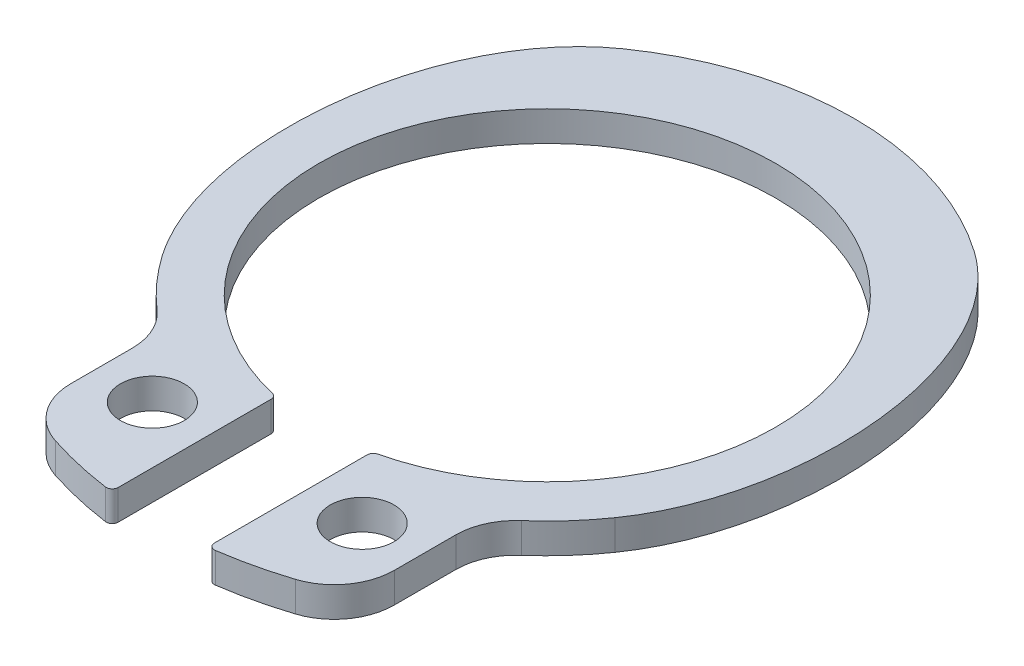
ISO-10303-21;
HEADER;
FILE_DESCRIPTION(('STEP AP214'),'2;1');
FILE_NAME('part.step','',(''),(''),'','','');
FILE_SCHEMA(('AUTOMOTIVE_DESIGN { 1 0 10303 214 1 1 1 1 }'));
ENDSEC;
DATA;
#1=APPLICATION_CONTEXT('core data for automotive mechanical design processes');
#2=APPLICATION_PROTOCOL_DEFINITION('international standard','automotive_design',2000,#1);
#3=PRODUCT_CONTEXT('',#1,'mechanical');
#4=PRODUCT('Part','Part','',(#3));
#5=PRODUCT_RELATED_PRODUCT_CATEGORY('part','',(#4));
#6=PRODUCT_DEFINITION_FORMATION('','',#4);
#7=PRODUCT_DEFINITION_CONTEXT('part definition',#1,'design');
#8=PRODUCT_DEFINITION('design','',#6,#7);
#9=PRODUCT_DEFINITION_SHAPE('','',#8);
#10=(LENGTH_UNIT() NAMED_UNIT(*) SI_UNIT(.MILLI.,.METRE.));
#11=(NAMED_UNIT(*) PLANE_ANGLE_UNIT() SI_UNIT($,.RADIAN.));
#12=(NAMED_UNIT(*) SI_UNIT($,.STERADIAN.) SOLID_ANGLE_UNIT());
#13=UNCERTAINTY_MEASURE_WITH_UNIT(LENGTH_MEASURE(1.E-05),#10,'distance_accuracy_value','');
#14=(GEOMETRIC_REPRESENTATION_CONTEXT(3) GLOBAL_UNCERTAINTY_ASSIGNED_CONTEXT((#13)) GLOBAL_UNIT_ASSIGNED_CONTEXT((#10,
#11,#12)) REPRESENTATION_CONTEXT('',''));
#15=CARTESIAN_POINT('',(0.,0.,0.));
#16=DIRECTION('',(0.,0.,1.));
#17=DIRECTION('',(1.,0.,0.));
#18=AXIS2_PLACEMENT_3D('',#15,#16,#17);
#19=CARTESIAN_POINT('',(-0.45,-0.125,3.168201382488));
#20=DIRECTION('',(0.,1.,0.));
#21=DIRECTION('',(0.,0.,1.));
#22=AXIS2_PLACEMENT_3D('',#19,#20,#21);
#23=CYLINDRICAL_SURFACE('',#22,0.0500000000000001);
#24=CARTESIAN_POINT('',(-0.45,0.125,3.168201382488));
#25=DIRECTION('',(0.,1.,0.));
#26=DIRECTION('',(0.,0.,1.));
#27=AXIS2_PLACEMENT_3D('',#24,#25,#26);
#28=CIRCLE('',#27,0.0500000000000001);
#29=CARTESIAN_POINT('',(-0.457031249999959,0.125,3.21770452908938));
#30=VERTEX_POINT('',#29);
#31=CARTESIAN_POINT('',(-0.4,0.125,3.168201382488));
#32=VERTEX_POINT('',#31);
#33=EDGE_CURVE('E202',#30,#32,#28,.T.);
#34=ORIENTED_EDGE('',*,*,#33,.F.);
#35=DIRECTION('',(0.,1.,0.));
#36=VECTOR('',#35,1.);
#37=CARTESIAN_POINT('',(-0.457031249999959,-0.125,3.21770452908938));
#38=LINE('',#37,#36);
#39=CARTESIAN_POINT('',(-0.457031249999959,-0.125,3.21770452908938));
#40=VERTEX_POINT('',#39);
#41=EDGE_CURVE('E11',#40,#30,#38,.T.);
#42=ORIENTED_EDGE('',*,*,#41,.F.);
#43=CARTESIAN_POINT('',(-0.45,-0.125,3.168201382488));
#44=DIRECTION('',(0.,1.,0.));
#45=DIRECTION('',(0.,0.,1.));
#46=AXIS2_PLACEMENT_3D('',#43,#44,#45);
#47=CIRCLE('',#46,0.0500000000000001);
#48=CARTESIAN_POINT('',(-0.4,-0.125,3.168201382488));
#49=VERTEX_POINT('',#48);
#50=EDGE_CURVE('E269',#40,#49,#47,.T.);
#51=ORIENTED_EDGE('',*,*,#50,.T.);
#52=DIRECTION('',(0.,1.,0.));
#53=VECTOR('',#52,1.);
#54=CARTESIAN_POINT('',(-0.4,-0.125,3.168201382488));
#55=LINE('',#54,#53);
#56=EDGE_CURVE('E36',#49,#32,#55,.T.);
#57=ORIENTED_EDGE('',*,*,#56,.T.);
#58=EDGE_LOOP('',(#34,#42,#51,#57));
#59=FACE_BOUND('',#58,.T.);
#60=ADVANCED_FACE('F33',(#59),#23,.T.);
#61=CARTESIAN_POINT('',(0.,-0.125,0.));
#62=DIRECTION('',(0.,1.,0.));
#63=DIRECTION('',(0.,0.,1.));
#64=AXIS2_PLACEMENT_3D('',#61,#62,#63);
#65=CYLINDRICAL_SURFACE('',#64,3.24999999999982);
#66=CARTESIAN_POINT('',(0.,0.125,0.));
#67=DIRECTION('',(0.,1.,0.));
#68=DIRECTION('',(0.,0.,1.));
#69=AXIS2_PLACEMENT_3D('',#66,#67,#68);
#70=CIRCLE('',#69,3.24999999999982);
#71=CARTESIAN_POINT('',(-0.998636363636399,0.125,3.0927698610181));
#72=VERTEX_POINT('',#71);
#73=EDGE_CURVE('E267',#72,#30,#70,.T.);
#74=ORIENTED_EDGE('',*,*,#73,.F.);
#75=DIRECTION('',(0.,1.,0.));
#76=VECTOR('',#75,1.);
#77=CARTESIAN_POINT('',(-0.998636363636399,-0.125,3.0927698610181));
#78=LINE('',#77,#76);
#79=CARTESIAN_POINT('',(-0.998636363636399,-0.125,3.0927698610181));
#80=VERTEX_POINT('',#79);
#81=EDGE_CURVE('E42',#80,#72,#78,.T.);
#82=ORIENTED_EDGE('',*,*,#81,.F.);
#83=CARTESIAN_POINT('',(0.,-0.125,0.));
#84=DIRECTION('',(0.,1.,0.));
#85=DIRECTION('',(0.,0.,1.));
#86=AXIS2_PLACEMENT_3D('',#83,#84,#85);
#87=CIRCLE('',#86,3.24999999999982);
#88=EDGE_CURVE('E192',#80,#40,#87,.T.);
#89=ORIENTED_EDGE('',*,*,#88,.T.);
#90=ORIENTED_EDGE('',*,*,#41,.T.);
#91=EDGE_LOOP('',(#74,#82,#89,#90));
#92=FACE_BOUND('',#91,.T.);
#93=ADVANCED_FACE('F305',(#92),#65,.T.);
#94=CARTESIAN_POINT('',(-0.845,-0.125,2.616959113169));
#95=DIRECTION('',(0.,1.,0.));
#96=DIRECTION('',(0.,0.,1.));
#97=AXIS2_PLACEMENT_3D('',#94,#95,#96);
#98=CYLINDRICAL_SURFACE('',#97,0.500000000000134);
#99=CARTESIAN_POINT('',(-0.845,0.125,2.616959113169));
#100=DIRECTION('',(0.,1.,0.));
#101=DIRECTION('',(0.,0.,1.));
#102=AXIS2_PLACEMENT_3D('',#99,#100,#101);
#103=CIRCLE('',#102,0.500000000000134);
#104=CARTESIAN_POINT('',(-1.34500000000013,0.125,2.61695911316899));
#105=VERTEX_POINT('',#104);
#106=EDGE_CURVE('E179',#105,#72,#103,.T.);
#107=ORIENTED_EDGE('',*,*,#106,.F.);
#108=DIRECTION('',(0.,1.,0.));
#109=VECTOR('',#108,1.);
#110=CARTESIAN_POINT('',(-1.34500000000013,-0.125,2.61695911316899));
#111=LINE('',#110,#109);
#112=CARTESIAN_POINT('',(-1.34500000000013,-0.125,2.61695911316899));
#113=VERTEX_POINT('',#112);
#114=EDGE_CURVE('E174',#113,#105,#111,.T.);
#115=ORIENTED_EDGE('',*,*,#114,.F.);
#116=CARTESIAN_POINT('',(-0.845,-0.125,2.616959113169));
#117=DIRECTION('',(0.,1.,0.));
#118=DIRECTION('',(0.,0.,1.));
#119=AXIS2_PLACEMENT_3D('',#116,#117,#118);
#120=CIRCLE('',#119,0.500000000000134);
#121=EDGE_CURVE('E177',#113,#80,#120,.T.);
#122=ORIENTED_EDGE('',*,*,#121,.T.);
#123=ORIENTED_EDGE('',*,*,#81,.T.);
#124=EDGE_LOOP('',(#107,#115,#122,#123));
#125=FACE_BOUND('',#124,.T.);
#126=ADVANCED_FACE('F176',(#125),#98,.T.);
#127=CARTESIAN_POINT('',(-1.34500000000013,-0.125,2.10617544378409));
#128=DIRECTION('',(-1.,0.,0.));
#129=DIRECTION('',(0.,0.,1.));
#130=AXIS2_PLACEMENT_3D('',#127,#128,#129);
#131=PLANE('',#130);
#132=DIRECTION('',(0.,0.,1.));
#133=VECTOR('',#132,1.);
#134=CARTESIAN_POINT('',(-1.34500000000013,0.125,2.10617544378409));
#135=LINE('',#134,#133);
#136=CARTESIAN_POINT('',(-1.34500000000013,0.125,2.10617544378409));
#137=VERTEX_POINT('',#136);
#138=EDGE_CURVE('E264',#137,#105,#135,.T.);
#139=ORIENTED_EDGE('',*,*,#138,.F.);
#140=DIRECTION('',(0.,1.,0.));
#141=VECTOR('',#140,1.);
#142=CARTESIAN_POINT('',(-1.34500000000013,-0.125,2.10617544378409));
#143=LINE('',#142,#141);
#144=CARTESIAN_POINT('',(-1.34500000000013,-0.125,2.10617544378409));
#145=VERTEX_POINT('',#144);
#146=EDGE_CURVE('E184',#145,#137,#143,.T.);
#147=ORIENTED_EDGE('',*,*,#146,.F.);
#148=DIRECTION('',(0.,0.,1.));
#149=VECTOR('',#148,1.);
#150=CARTESIAN_POINT('',(-1.34500000000013,-0.125,2.10617544378409));
#151=LINE('',#150,#149);
#152=EDGE_CURVE('E190',#145,#113,#151,.T.);
#153=ORIENTED_EDGE('',*,*,#152,.T.);
#154=ORIENTED_EDGE('',*,*,#114,.T.);
#155=EDGE_LOOP('',(#139,#147,#153,#154));
#156=FACE_BOUND('',#155,.T.);
#157=ADVANCED_FACE('F194',(#156),#131,.T.);
#158=CARTESIAN_POINT('',(-1.84500000000007,-0.125,2.10617544378409));
#159=DIRECTION('',(0.,1.,0.));
#160=DIRECTION('',(0.,0.,1.));
#161=AXIS2_PLACEMENT_3D('',#158,#159,#160);
#162=CYLINDRICAL_SURFACE('',#161,0.499999999999943);
#163=CARTESIAN_POINT('',(-1.84500000000007,0.125,2.10617544378409));
#164=DIRECTION('',(0.,-1.,0.));
#165=DIRECTION('',(0.,0.,-1.));
#166=AXIS2_PLACEMENT_3D('',#163,#164,#165);
#167=CIRCLE('',#166,0.499999999999943);
#168=CARTESIAN_POINT('',(-1.51553571428582,0.125,1.73007268596555));
#169=VERTEX_POINT('',#168);
#170=EDGE_CURVE('E261',#169,#137,#167,.T.);
#171=ORIENTED_EDGE('',*,*,#170,.F.);
#172=DIRECTION('',(0.,1.,0.));
#173=VECTOR('',#172,1.);
#174=CARTESIAN_POINT('',(-1.51553571428582,-0.125,1.73007268596555));
#175=LINE('',#174,#173);
#176=CARTESIAN_POINT('',(-1.51553571428582,-0.125,1.73007268596555));
#177=VERTEX_POINT('',#176);
#178=EDGE_CURVE('E273',#177,#169,#175,.T.);
#179=ORIENTED_EDGE('',*,*,#178,.F.);
#180=CARTESIAN_POINT('',(-1.84500000000007,-0.125,2.10617544378409));
#181=DIRECTION('',(0.,-1.,0.));
#182=DIRECTION('',(0.,0.,-1.));
#183=AXIS2_PLACEMENT_3D('',#180,#181,#182);
#184=CIRCLE('',#183,0.499999999999943);
#185=EDGE_CURVE('E195',#177,#145,#184,.T.);
#186=ORIENTED_EDGE('',*,*,#185,.T.);
#187=ORIENTED_EDGE('',*,*,#146,.T.);
#188=EDGE_LOOP('',(#171,#179,#186,#187));
#189=FACE_BOUND('',#188,.T.);
#190=ADVANCED_FACE('F318',(#189),#162,.F.);
#191=CARTESIAN_POINT('',(0.,-0.125,0.));
#192=DIRECTION('',(0.,1.,0.));
#193=DIRECTION('',(0.,0.,1.));
#194=AXIS2_PLACEMENT_3D('',#191,#192,#193);
#195=CYLINDRICAL_SURFACE('',#194,2.29999999999997);
#196=CARTESIAN_POINT('',(0.,0.125,0.));
#197=DIRECTION('',(0.,1.,0.));
#198=DIRECTION('',(0.,0.,1.));
#199=AXIS2_PLACEMENT_3D('',#196,#197,#198);
#200=CIRCLE('',#199,2.29999999999997);
#201=CARTESIAN_POINT('',(-1.88404970186493,0.125,1.31922580360695));
#202=VERTEX_POINT('',#201);
#203=EDGE_CURVE('E255',#202,#169,#200,.T.);
#204=ORIENTED_EDGE('',*,*,#203,.F.);
#205=DIRECTION('',(0.,1.,0.));
#206=VECTOR('',#205,1.);
#207=CARTESIAN_POINT('',(-1.88404970186493,-0.125,1.31922580360695));
#208=LINE('',#207,#206);
#209=CARTESIAN_POINT('',(-1.88404970186493,-0.125,1.31922580360695));
#210=VERTEX_POINT('',#209);
#211=EDGE_CURVE('E275',#210,#202,#208,.T.);
#212=ORIENTED_EDGE('',*,*,#211,.F.);
#213=CARTESIAN_POINT('',(0.,-0.125,0.));
#214=DIRECTION('',(0.,1.,0.));
#215=DIRECTION('',(0.,0.,1.));
#216=AXIS2_PLACEMENT_3D('',#213,#214,#215);
#217=CIRCLE('',#216,2.29999999999997);
#218=EDGE_CURVE('E197',#210,#177,#217,.T.);
#219=ORIENTED_EDGE('',*,*,#218,.T.);
#220=ORIENTED_EDGE('',*,*,#178,.T.);
#221=EDGE_LOOP('',(#204,#212,#219,#220));
#222=FACE_BOUND('',#221,.T.);
#223=ADVANCED_FACE('F321',(#222),#195,.T.);
#224=CARTESIAN_POINT('',(-1.46261991269529,-0.125,-2.08883771293742));
#225=CARTESIAN_POINT('',(-1.6155306939898,-0.125,-1.98176843120135));
#226=CARTESIAN_POINT('',(-1.74786933276423,-0.125,-1.84200515271834));
#227=CARTESIAN_POINT('',(-1.85450095274819,-0.125,-1.68878884892801));
#228=CARTESIAN_POINT('',(-1.99546026918019,-0.125,-1.48624793796961));
#229=CARTESIAN_POINT('',(-2.0977800915544,-0.125,-1.25460186872934));
#230=CARTESIAN_POINT('',(-2.16732858795415,-0.125,-1.01784174508229));
#231=CARTESIAN_POINT('',(-2.26444958592378,-0.125,-0.687218069829198));
#232=CARTESIAN_POINT('',(-2.30237871375998,-0.125,-0.335122463083965));
#233=CARTESIAN_POINT('',(-2.28613934206715,-0.125,0.00908791690405493));
#234=CARTESIAN_POINT('',(-2.26965827246097,-0.125,0.358421335650343));
#235=CARTESIAN_POINT('',(-2.19677877389437,-0.125,0.714119474283422));
#236=CARTESIAN_POINT('',(-2.04907703540922,-0.125,1.03112051459212));
#237=CARTESIAN_POINT('',(-2.00233491356865,-0.125,1.13143958599689));
#238=CARTESIAN_POINT('',(-1.94752972050468,-0.125,1.22856694151852));
#239=CARTESIAN_POINT('',(-1.88404970186493,-0.125,1.31922580360695));
#240=B_SPLINE_CURVE_WITH_KNOTS('',3,(#224,#225,#226,#227,#228,#229,#230,#231,#232,#233,#234,
#235,#236,#237,#238,#239),.UNSPECIFIED.,.F.,.F.,(4,3,3,3,3,4),(0.,0.000560008788456189,
0.00130088828889166,0.00233883949188015,0.00339561191091467,0.00372398774746972),.UNSPECIFIED.);
#241=DIRECTION('',(0.,1.,0.));
#242=VECTOR('',#241,1.);
#243=SURFACE_OF_LINEAR_EXTRUSION('',#240,#242);
#244=CARTESIAN_POINT('',(-1.46261991269529,0.125,-2.08883771293742));
#245=CARTESIAN_POINT('',(-1.6155306939898,0.125,-1.98176843120135));
#246=CARTESIAN_POINT('',(-1.74786933276423,0.125,-1.84200515271834));
#247=CARTESIAN_POINT('',(-1.85450095274819,0.125,-1.68878884892801));
#248=CARTESIAN_POINT('',(-1.99546026918019,0.125,-1.48624793796961));
#249=CARTESIAN_POINT('',(-2.0977800915544,0.125,-1.25460186872934));
#250=CARTESIAN_POINT('',(-2.16732858795415,0.125,-1.01784174508229));
#251=CARTESIAN_POINT('',(-2.26444958592378,0.125,-0.687218069829198));
#252=CARTESIAN_POINT('',(-2.30237871375998,0.125,-0.335122463083965));
#253=CARTESIAN_POINT('',(-2.28613934206715,0.125,0.00908791690405493));
#254=CARTESIAN_POINT('',(-2.26965827246097,0.125,0.358421335650343));
#255=CARTESIAN_POINT('',(-2.19677877389437,0.125,0.714119474283422));
#256=CARTESIAN_POINT('',(-2.04907703540922,0.125,1.03112051459212));
#257=CARTESIAN_POINT('',(-2.00233491356865,0.125,1.13143958599689));
#258=CARTESIAN_POINT('',(-1.94752972050468,0.125,1.22856694151852));
#259=CARTESIAN_POINT('',(-1.88404970186493,0.125,1.31922580360695));
#260=B_SPLINE_CURVE_WITH_KNOTS('',3,(#244,#245,#246,#247,#248,#249,#250,#251,#252,#253,#254,
#255,#256,#257,#258,#259),.UNSPECIFIED.,.F.,.F.,(4,3,3,3,3,4),(0.,0.000560008788456189,
0.00130088828889166,0.00233883949188015,0.00339561191091467,0.00372398774746972),.UNSPECIFIED.);
#261=CARTESIAN_POINT('',(-1.46261991269529,0.125,-2.08883771293742));
#262=VERTEX_POINT('',#261);
#263=EDGE_CURVE('E250',#262,#202,#260,.T.);
#264=ORIENTED_EDGE('',*,*,#263,.F.);
#265=DIRECTION('',(0.,1.,0.));
#266=VECTOR('',#265,1.);
#267=CARTESIAN_POINT('',(-1.46261991269529,-0.125,-2.08883771293742));
#268=LINE('',#267,#266);
#269=CARTESIAN_POINT('',(-1.46261991269529,-0.125,-2.08883771293742));
#270=VERTEX_POINT('',#269);
#271=EDGE_CURVE('E277',#270,#262,#268,.T.);
#272=ORIENTED_EDGE('',*,*,#271,.F.);
#273=EDGE_CURVE('E333',#270,#210,#240,.T.);
#274=ORIENTED_EDGE('',*,*,#273,.T.);
#275=ORIENTED_EDGE('',*,*,#211,.T.);
#276=EDGE_LOOP('',(#264,#272,#274,#275));
#277=FACE_BOUND('',#276,.T.);
#278=ADVANCED_FACE('F325',(#277),#243,.T.);
#279=CARTESIAN_POINT('',(0.,-0.125,0.));
#280=DIRECTION('',(0.,1.,0.));
#281=DIRECTION('',(0.,0.,1.));
#282=AXIS2_PLACEMENT_3D('',#279,#280,#281);
#283=CYLINDRICAL_SURFACE('',#282,2.55000000000047);
#284=CARTESIAN_POINT('',(0.,0.125,0.));
#285=DIRECTION('',(0.,1.,0.));
#286=DIRECTION('',(0.,0.,1.));
#287=AXIS2_PLACEMENT_3D('',#284,#285,#286);
#288=CIRCLE('',#287,2.55000000000047);
#289=CARTESIAN_POINT('',(1.46261991269531,0.125,-2.08883771293741));
#290=VERTEX_POINT('',#289);
#291=EDGE_CURVE('E244',#290,#262,#288,.T.);
#292=ORIENTED_EDGE('',*,*,#291,.F.);
#293=DIRECTION('',(0.,1.,0.));
#294=VECTOR('',#293,1.);
#295=CARTESIAN_POINT('',(1.46261991269531,-0.125,-2.08883771293741));
#296=LINE('',#295,#294);
#297=CARTESIAN_POINT('',(1.46261991269531,-0.125,-2.08883771293741));
#298=VERTEX_POINT('',#297);
#299=EDGE_CURVE('E279',#298,#290,#296,.T.);
#300=ORIENTED_EDGE('',*,*,#299,.F.);
#301=CARTESIAN_POINT('',(0.,-0.125,0.));
#302=DIRECTION('',(0.,1.,0.));
#303=DIRECTION('',(0.,0.,1.));
#304=AXIS2_PLACEMENT_3D('',#301,#302,#303);
#305=CIRCLE('',#304,2.55000000000047);
#306=EDGE_CURVE('E339',#298,#270,#305,.T.);
#307=ORIENTED_EDGE('',*,*,#306,.T.);
#308=ORIENTED_EDGE('',*,*,#271,.T.);
#309=EDGE_LOOP('',(#292,#300,#307,#308));
#310=FACE_BOUND('',#309,.T.);
#311=ADVANCED_FACE('F330',(#310),#283,.T.);
#312=CARTESIAN_POINT('',(1.88404970186525,-0.125,1.3192258036065));
#313=CARTESIAN_POINT('',(2.01902897506243,-0.125,1.1264554236381));
#314=CARTESIAN_POINT('',(2.11511016190428,-0.125,0.904375316196927));
#315=CARTESIAN_POINT('',(2.17946032705223,-0.125,0.6780152494196));
#316=CARTESIAN_POINT('',(2.27015310436415,-0.125,0.358991621720318));
#317=CARTESIAN_POINT('',(2.30250122825986,-0.125,0.0198992452615869));
#318=CARTESIAN_POINT('',(2.28538737439286,-0.125,-0.31132329457044));
#319=CARTESIAN_POINT('',(2.26784311952617,-0.125,-0.650875840803742));
#320=CARTESIAN_POINT('',(2.19755107846837,-0.125,-0.994363091037852));
#321=CARTESIAN_POINT('',(2.06391741811087,-0.125,-1.30700630198574));
#322=CARTESIAN_POINT('',(1.98464505194974,-0.125,-1.4924683108071));
#323=CARTESIAN_POINT('',(1.88078203974534,-0.125,-1.67066980685565));
#324=CARTESIAN_POINT('',(1.75028858684848,-0.125,-1.82446097534037));
#325=CARTESIAN_POINT('',(1.66602855769958,-0.125,-1.92376441203929));
#326=CARTESIAN_POINT('',(1.56930145531106,-0.125,-2.01413849261007));
#327=CARTESIAN_POINT('',(1.46261991269531,-0.125,-2.08883771293741));
#328=B_SPLINE_CURVE_WITH_KNOTS('',3,(#312,#313,#314,#315,#316,#317,#318,#319,#320,#321,#322,
#323,#324,#325,#326,#327),.UNSPECIFIED.,.F.,.F.,(4,3,3,3,3,4),(0.,0.000705987543993548,
0.00170352357713237,0.00272765257922384,0.0033307815747171,0.00371830006365464),.UNSPECIFIED.);
#329=DIRECTION('',(0.,1.,0.));
#330=VECTOR('',#329,1.);
#331=SURFACE_OF_LINEAR_EXTRUSION('',#328,#330);
#332=CARTESIAN_POINT('',(1.88404970186525,0.125,1.3192258036065));
#333=CARTESIAN_POINT('',(2.01902897506243,0.125,1.1264554236381));
#334=CARTESIAN_POINT('',(2.11511016190428,0.125,0.904375316196927));
#335=CARTESIAN_POINT('',(2.17946032705223,0.125,0.6780152494196));
#336=CARTESIAN_POINT('',(2.27015310436415,0.125,0.358991621720318));
#337=CARTESIAN_POINT('',(2.30250122825986,0.125,0.0198992452615869));
#338=CARTESIAN_POINT('',(2.28538737439286,0.125,-0.31132329457044));
#339=CARTESIAN_POINT('',(2.26784311952617,0.125,-0.650875840803742));
#340=CARTESIAN_POINT('',(2.19755107846837,0.125,-0.994363091037852));
#341=CARTESIAN_POINT('',(2.06391741811087,0.125,-1.30700630198574));
#342=CARTESIAN_POINT('',(1.98464505194974,0.125,-1.4924683108071));
#343=CARTESIAN_POINT('',(1.88078203974534,0.125,-1.67066980685565));
#344=CARTESIAN_POINT('',(1.75028858684848,0.125,-1.82446097534037));
#345=CARTESIAN_POINT('',(1.66602855769958,0.125,-1.92376441203929));
#346=CARTESIAN_POINT('',(1.56930145531106,0.125,-2.01413849261007));
#347=CARTESIAN_POINT('',(1.46261991269531,0.125,-2.08883771293741));
#348=B_SPLINE_CURVE_WITH_KNOTS('',3,(#332,#333,#334,#335,#336,#337,#338,#339,#340,#341,#342,
#343,#344,#345,#346,#347),.UNSPECIFIED.,.F.,.F.,(4,3,3,3,3,4),(0.,0.000705987543993548,
0.00170352357713237,0.00272765257922384,0.0033307815747171,0.00371830006365464),.UNSPECIFIED.);
#349=CARTESIAN_POINT('',(1.88404970186525,0.125,1.3192258036065));
#350=VERTEX_POINT('',#349);
#351=EDGE_CURVE('E239',#350,#290,#348,.T.);
#352=ORIENTED_EDGE('',*,*,#351,.F.);
#353=DIRECTION('',(0.,1.,0.));
#354=VECTOR('',#353,1.);
#355=CARTESIAN_POINT('',(1.88404970186525,-0.125,1.3192258036065));
#356=LINE('',#355,#354);
#357=CARTESIAN_POINT('',(1.88404970186525,-0.125,1.3192258036065));
#358=VERTEX_POINT('',#357);
#359=EDGE_CURVE('E281',#358,#350,#356,.T.);
#360=ORIENTED_EDGE('',*,*,#359,.F.);
#361=EDGE_CURVE('E356',#358,#298,#328,.T.);
#362=ORIENTED_EDGE('',*,*,#361,.T.);
#363=ORIENTED_EDGE('',*,*,#299,.T.);
#364=EDGE_LOOP('',(#352,#360,#362,#363));
#365=FACE_BOUND('',#364,.T.);
#366=ADVANCED_FACE('F369',(#365),#331,.T.);
#367=CARTESIAN_POINT('',(0.,-0.125,0.));
#368=DIRECTION('',(0.,1.,0.));
#369=DIRECTION('',(0.,0.,1.));
#370=AXIS2_PLACEMENT_3D('',#367,#368,#369);
#371=CYLINDRICAL_SURFACE('',#370,2.29999999999994);
#372=CARTESIAN_POINT('',(0.,0.125,0.));
#373=DIRECTION('',(0.,1.,0.));
#374=DIRECTION('',(0.,0.,1.));
#375=AXIS2_PLACEMENT_3D('',#372,#373,#374);
#376=CIRCLE('',#375,2.29999999999994);
#377=CARTESIAN_POINT('',(1.51553571428579,0.125,1.73007268596552));
#378=VERTEX_POINT('',#377);
#379=EDGE_CURVE('E236',#378,#350,#376,.T.);
#380=ORIENTED_EDGE('',*,*,#379,.F.);
#381=DIRECTION('',(0.,1.,0.));
#382=VECTOR('',#381,1.);
#383=CARTESIAN_POINT('',(1.51553571428579,-0.125,1.73007268596552));
#384=LINE('',#383,#382);
#385=CARTESIAN_POINT('',(1.51553571428579,-0.125,1.73007268596552));
#386=VERTEX_POINT('',#385);
#387=EDGE_CURVE('E283',#386,#378,#384,.T.);
#388=ORIENTED_EDGE('',*,*,#387,.F.);
#389=CARTESIAN_POINT('',(0.,-0.125,0.));
#390=DIRECTION('',(0.,1.,0.));
#391=DIRECTION('',(0.,0.,1.));
#392=AXIS2_PLACEMENT_3D('',#389,#390,#391);
#393=CIRCLE('',#392,2.29999999999994);
#394=EDGE_CURVE('E357',#386,#358,#393,.T.);
#395=ORIENTED_EDGE('',*,*,#394,.T.);
#396=ORIENTED_EDGE('',*,*,#359,.T.);
#397=EDGE_LOOP('',(#380,#388,#395,#396));
#398=FACE_BOUND('',#397,.T.);
#399=ADVANCED_FACE('F372',(#398),#371,.T.);
#400=CARTESIAN_POINT('',(1.845,-0.125,2.106175443784));
#401=DIRECTION('',(0.,1.,0.));
#402=DIRECTION('',(0.,0.,1.));
#403=AXIS2_PLACEMENT_3D('',#400,#401,#402);
#404=CYLINDRICAL_SURFACE('',#403,0.499999999999839);
#405=CARTESIAN_POINT('',(1.845,0.125,2.106175443784));
#406=DIRECTION('',(0.,-1.,0.));
#407=DIRECTION('',(0.,0.,-1.));
#408=AXIS2_PLACEMENT_3D('',#405,#406,#407);
#409=CIRCLE('',#408,0.499999999999839);
#410=CARTESIAN_POINT('',(1.34500000000015,0.125,2.10617544378404));
#411=VERTEX_POINT('',#410);
#412=EDGE_CURVE('E233',#411,#378,#409,.T.);
#413=ORIENTED_EDGE('',*,*,#412,.F.);
#414=DIRECTION('',(0.,1.,0.));
#415=VECTOR('',#414,1.);
#416=CARTESIAN_POINT('',(1.34500000000015,-0.125,2.10617544378404));
#417=LINE('',#416,#415);
#418=CARTESIAN_POINT('',(1.34500000000015,-0.125,2.10617544378404));
#419=VERTEX_POINT('',#418);
#420=EDGE_CURVE('E285',#419,#411,#417,.T.);
#421=ORIENTED_EDGE('',*,*,#420,.F.);
#422=CARTESIAN_POINT('',(1.845,-0.125,2.106175443784));
#423=DIRECTION('',(0.,-1.,0.));
#424=DIRECTION('',(0.,0.,-1.));
#425=AXIS2_PLACEMENT_3D('',#422,#423,#424);
#426=CIRCLE('',#425,0.499999999999839);
#427=EDGE_CURVE('E360',#419,#386,#426,.T.);
#428=ORIENTED_EDGE('',*,*,#427,.T.);
#429=ORIENTED_EDGE('',*,*,#387,.T.);
#430=EDGE_LOOP('',(#413,#421,#428,#429));
#431=FACE_BOUND('',#430,.T.);
#432=ADVANCED_FACE('F375',(#431),#404,.F.);
#433=CARTESIAN_POINT('',(1.34500000000015,-0.125,2.6169591131691));
#434=DIRECTION('',(1.,0.,0.));
#435=DIRECTION('',(0.,0.,-1.));
#436=AXIS2_PLACEMENT_3D('',#433,#434,#435);
#437=PLANE('',#436);
#438=DIRECTION('',(0.,0.,-1.));
#439=VECTOR('',#438,1.);
#440=CARTESIAN_POINT('',(1.34500000000015,0.125,2.6169591131691));
#441=LINE('',#440,#439);
#442=CARTESIAN_POINT('',(1.34500000000015,0.125,2.6169591131691));
#443=VERTEX_POINT('',#442);
#444=EDGE_CURVE('E230',#443,#411,#441,.T.);
#445=ORIENTED_EDGE('',*,*,#444,.F.);
#446=DIRECTION('',(0.,1.,0.));
#447=VECTOR('',#446,1.);
#448=CARTESIAN_POINT('',(1.34500000000015,-0.125,2.6169591131691));
#449=LINE('',#448,#447);
#450=CARTESIAN_POINT('',(1.34500000000015,-0.125,2.6169591131691));
#451=VERTEX_POINT('',#450);
#452=EDGE_CURVE('E287',#451,#443,#449,.T.);
#453=ORIENTED_EDGE('',*,*,#452,.F.);
#454=DIRECTION('',(0.,0.,-1.));
#455=VECTOR('',#454,1.);
#456=CARTESIAN_POINT('',(1.34500000000015,-0.125,2.6169591131691));
#457=LINE('',#456,#455);
#458=EDGE_CURVE('E470',#451,#419,#457,.T.);
#459=ORIENTED_EDGE('',*,*,#458,.T.);
#460=ORIENTED_EDGE('',*,*,#420,.T.);
#461=EDGE_LOOP('',(#445,#453,#459,#460));
#462=FACE_BOUND('',#461,.T.);
#463=ADVANCED_FACE('F379',(#462),#437,.T.);
#464=CARTESIAN_POINT('',(0.845000000000151,-0.125,2.6169591131691));
#465=DIRECTION('',(0.,1.,0.));
#466=DIRECTION('',(0.,0.,1.));
#467=AXIS2_PLACEMENT_3D('',#464,#465,#466);
#468=CYLINDRICAL_SURFACE('',#467,0.5);
#469=CARTESIAN_POINT('',(0.845000000000151,0.125,2.6169591131691));
#470=DIRECTION('',(0.,1.,0.));
#471=DIRECTION('',(0.,0.,1.));
#472=AXIS2_PLACEMENT_3D('',#469,#470,#471);
#473=CIRCLE('',#472,0.5);
#474=CARTESIAN_POINT('',(0.998636363636553,0.125,3.09276986101805));
#475=VERTEX_POINT('',#474);
#476=EDGE_CURVE('E227',#475,#443,#473,.T.);
#477=ORIENTED_EDGE('',*,*,#476,.F.);
#478=DIRECTION('',(0.,1.,0.));
#479=VECTOR('',#478,1.);
#480=CARTESIAN_POINT('',(0.998636363636553,-0.125,3.09276986101805));
#481=LINE('',#480,#479);
#482=CARTESIAN_POINT('',(0.998636363636553,-0.125,3.09276986101805));
#483=VERTEX_POINT('',#482);
#484=EDGE_CURVE('E289',#483,#475,#481,.T.);
#485=ORIENTED_EDGE('',*,*,#484,.F.);
#486=CARTESIAN_POINT('',(0.845000000000151,-0.125,2.6169591131691));
#487=DIRECTION('',(0.,1.,0.));
#488=DIRECTION('',(0.,0.,1.));
#489=AXIS2_PLACEMENT_3D('',#486,#487,#488);
#490=CIRCLE('',#489,0.5);
#491=EDGE_CURVE('E467',#483,#451,#490,.T.);
#492=ORIENTED_EDGE('',*,*,#491,.T.);
#493=ORIENTED_EDGE('',*,*,#452,.T.);
#494=EDGE_LOOP('',(#477,#485,#492,#493));
#495=FACE_BOUND('',#494,.T.);
#496=ADVANCED_FACE('F383',(#495),#468,.T.);
#497=CARTESIAN_POINT('',(0.,-0.125,0.));
#498=DIRECTION('',(0.,1.,0.));
#499=DIRECTION('',(0.,0.,1.));
#500=AXIS2_PLACEMENT_3D('',#497,#498,#499);
#501=CYLINDRICAL_SURFACE('',#500,3.24999999999983);
#502=CARTESIAN_POINT('',(0.,0.125,0.));
#503=DIRECTION('',(0.,1.,0.));
#504=DIRECTION('',(0.,0.,1.));
#505=AXIS2_PLACEMENT_3D('',#502,#503,#504);
#506=CIRCLE('',#505,3.24999999999983);
#507=CARTESIAN_POINT('',(0.457031250000104,0.125,3.21770452908936));
#508=VERTEX_POINT('',#507);
#509=EDGE_CURVE('E224',#508,#475,#506,.T.);
#510=ORIENTED_EDGE('',*,*,#509,.F.);
#511=DIRECTION('',(0.,1.,0.));
#512=VECTOR('',#511,1.);
#513=CARTESIAN_POINT('',(0.457031250000104,-0.125,3.21770452908936));
#514=LINE('',#513,#512);
#515=CARTESIAN_POINT('',(0.457031250000104,-0.125,3.21770452908936));
#516=VERTEX_POINT('',#515);
#517=EDGE_CURVE('E291',#516,#508,#514,.T.);
#518=ORIENTED_EDGE('',*,*,#517,.F.);
#519=CARTESIAN_POINT('',(0.,-0.125,0.));
#520=DIRECTION('',(0.,1.,0.));
#521=DIRECTION('',(0.,0.,1.));
#522=AXIS2_PLACEMENT_3D('',#519,#520,#521);
#523=CIRCLE('',#522,3.24999999999983);
#524=EDGE_CURVE('E464',#516,#483,#523,.T.);
#525=ORIENTED_EDGE('',*,*,#524,.T.);
#526=ORIENTED_EDGE('',*,*,#484,.T.);
#527=EDGE_LOOP('',(#510,#518,#525,#526));
#528=FACE_BOUND('',#527,.T.);
#529=ADVANCED_FACE('F387',(#528),#501,.T.);
#530=CARTESIAN_POINT('',(0.450000000000089,-0.125,3.1682013824879));
#531=DIRECTION('',(0.,1.,0.));
#532=DIRECTION('',(0.,0.,1.));
#533=AXIS2_PLACEMENT_3D('',#530,#531,#532);
#534=CYLINDRICAL_SURFACE('',#533,0.0500000000000879);
#535=CARTESIAN_POINT('',(0.450000000000089,0.125,3.1682013824879));
#536=DIRECTION('',(0.,1.,0.));
#537=DIRECTION('',(0.,0.,1.));
#538=AXIS2_PLACEMENT_3D('',#535,#536,#537);
#539=CIRCLE('',#538,0.0500000000000879);
#540=CARTESIAN_POINT('',(0.400000000000001,0.125,3.1682013824879));
#541=VERTEX_POINT('',#540);
#542=EDGE_CURVE('E221',#541,#508,#539,.T.);
#543=ORIENTED_EDGE('',*,*,#542,.F.);
#544=DIRECTION('',(0.,1.,0.));
#545=VECTOR('',#544,1.);
#546=CARTESIAN_POINT('',(0.400000000000001,-0.125,3.1682013824879));
#547=LINE('',#546,#545);
#548=CARTESIAN_POINT('',(0.400000000000001,-0.125,3.1682013824879));
#549=VERTEX_POINT('',#548);
#550=EDGE_CURVE('E293',#549,#541,#547,.T.);
#551=ORIENTED_EDGE('',*,*,#550,.F.);
#552=CARTESIAN_POINT('',(0.450000000000089,-0.125,3.1682013824879));
#553=DIRECTION('',(0.,1.,0.));
#554=DIRECTION('',(0.,0.,1.));
#555=AXIS2_PLACEMENT_3D('',#552,#553,#554);
#556=CIRCLE('',#555,0.0500000000000879);
#557=EDGE_CURVE('E461',#549,#516,#556,.T.);
#558=ORIENTED_EDGE('',*,*,#557,.T.);
#559=ORIENTED_EDGE('',*,*,#517,.T.);
#560=EDGE_LOOP('',(#543,#551,#558,#559));
#561=FACE_BOUND('',#560,.T.);
#562=ADVANCED_FACE('F391',(#561),#534,.T.);
#563=CARTESIAN_POINT('',(0.4,-0.125,1.897366596101));
#564=DIRECTION('',(-1.,0.,0.));
#565=DIRECTION('',(0.,0.,1.));
#566=AXIS2_PLACEMENT_3D('',#563,#564,#565);
#567=PLANE('',#566);
#568=DIRECTION('',(0.,0.,1.));
#569=VECTOR('',#568,1.);
#570=CARTESIAN_POINT('',(0.4,0.125,1.897366596101));
#571=LINE('',#570,#569);
#572=CARTESIAN_POINT('',(0.4,0.125,1.897366596101));
#573=VERTEX_POINT('',#572);
#574=EDGE_CURVE('E218',#573,#541,#571,.T.);
#575=ORIENTED_EDGE('',*,*,#574,.F.);
#576=DIRECTION('',(0.,1.,0.));
#577=VECTOR('',#576,1.);
#578=CARTESIAN_POINT('',(0.4,-0.125,1.897366596101));
#579=LINE('',#578,#577);
#580=CARTESIAN_POINT('',(0.4,-0.125,1.897366596101));
#581=VERTEX_POINT('',#580);
#582=EDGE_CURVE('E295',#581,#573,#579,.T.);
#583=ORIENTED_EDGE('',*,*,#582,.F.);
#584=DIRECTION('',(0.,0.,1.));
#585=VECTOR('',#584,1.);
#586=CARTESIAN_POINT('',(0.4,-0.125,1.897366596101));
#587=LINE('',#586,#585);
#588=EDGE_CURVE('E458',#581,#549,#587,.T.);
#589=ORIENTED_EDGE('',*,*,#588,.T.);
#590=ORIENTED_EDGE('',*,*,#550,.T.);
#591=EDGE_LOOP('',(#575,#583,#589,#590));
#592=FACE_BOUND('',#591,.T.);
#593=ADVANCED_FACE('F395',(#592),#567,.T.);
#594=CARTESIAN_POINT('',(0.45,-0.125,1.897366596101));
#595=DIRECTION('',(0.,1.,0.));
#596=DIRECTION('',(0.,0.,1.));
#597=AXIS2_PLACEMENT_3D('',#594,#595,#596);
#598=CYLINDRICAL_SURFACE('',#597,0.05);
#599=CARTESIAN_POINT('',(0.45,0.125,1.897366596101));
#600=DIRECTION('',(0.,1.,0.));
#601=DIRECTION('',(0.,0.,1.));
#602=AXIS2_PLACEMENT_3D('',#599,#600,#601);
#603=CIRCLE('',#602,0.05);
#604=CARTESIAN_POINT('',(0.438461538461517,0.125,1.84871617055996));
#605=VERTEX_POINT('',#604);
#606=EDGE_CURVE('E215',#605,#573,#603,.T.);
#607=ORIENTED_EDGE('',*,*,#606,.F.);
#608=DIRECTION('',(0.,1.,0.));
#609=VECTOR('',#608,1.);
#610=CARTESIAN_POINT('',(0.438461538461517,-0.125,1.84871617055996));
#611=LINE('',#610,#609);
#612=CARTESIAN_POINT('',(0.438461538461517,-0.125,1.84871617055996));
#613=VERTEX_POINT('',#612);
#614=EDGE_CURVE('E297',#613,#605,#611,.T.);
#615=ORIENTED_EDGE('',*,*,#614,.F.);
#616=CARTESIAN_POINT('',(0.45,-0.125,1.897366596101));
#617=DIRECTION('',(0.,1.,0.));
#618=DIRECTION('',(0.,0.,1.));
#619=AXIS2_PLACEMENT_3D('',#616,#617,#618);
#620=CIRCLE('',#619,0.05);
#621=EDGE_CURVE('E455',#613,#581,#620,.T.);
#622=ORIENTED_EDGE('',*,*,#621,.T.);
#623=ORIENTED_EDGE('',*,*,#582,.T.);
#624=EDGE_LOOP('',(#607,#615,#622,#623));
#625=FACE_BOUND('',#624,.T.);
#626=ADVANCED_FACE('F399',(#625),#598,.T.);
#627=CARTESIAN_POINT('',(0.,-0.125,0.));
#628=DIRECTION('',(0.,1.,0.));
#629=DIRECTION('',(0.,0.,1.));
#630=AXIS2_PLACEMENT_3D('',#627,#628,#629);
#631=CYLINDRICAL_SURFACE('',#630,1.89999999999998);
#632=CARTESIAN_POINT('',(0.,0.125,0.));
#633=DIRECTION('',(0.,-1.,0.));
#634=DIRECTION('',(0.,0.,-1.));
#635=AXIS2_PLACEMENT_3D('',#632,#633,#634);
#636=CIRCLE('',#635,1.89999999999998);
#637=CARTESIAN_POINT('',(-0.438461538461516,0.125,1.84871617055996));
#638=VERTEX_POINT('',#637);
#639=EDGE_CURVE('E212',#638,#605,#636,.T.);
#640=ORIENTED_EDGE('',*,*,#639,.F.);
#641=DIRECTION('',(0.,1.,0.));
#642=VECTOR('',#641,1.);
#643=CARTESIAN_POINT('',(-0.438461538461516,-0.125,1.84871617055996));
#644=LINE('',#643,#642);
#645=CARTESIAN_POINT('',(-0.438461538461516,-0.125,1.84871617055996));
#646=VERTEX_POINT('',#645);
#647=EDGE_CURVE('E299',#646,#638,#644,.T.);
#648=ORIENTED_EDGE('',*,*,#647,.F.);
#649=CARTESIAN_POINT('',(0.,-0.125,0.));
#650=DIRECTION('',(0.,-1.,0.));
#651=DIRECTION('',(0.,0.,-1.));
#652=AXIS2_PLACEMENT_3D('',#649,#650,#651);
#653=CIRCLE('',#652,1.89999999999998);
#654=EDGE_CURVE('E452',#646,#613,#653,.T.);
#655=ORIENTED_EDGE('',*,*,#654,.T.);
#656=ORIENTED_EDGE('',*,*,#614,.T.);
#657=EDGE_LOOP('',(#640,#648,#655,#656));
#658=FACE_BOUND('',#657,.T.);
#659=ADVANCED_FACE('F403',(#658),#631,.F.);
#660=CARTESIAN_POINT('',(-0.45,-0.125,1.897366596101));
#661=DIRECTION('',(0.,1.,0.));
#662=DIRECTION('',(0.,0.,1.));
#663=AXIS2_PLACEMENT_3D('',#660,#661,#662);
#664=CYLINDRICAL_SURFACE('',#663,0.0499999999999933);
#665=CARTESIAN_POINT('',(-0.45,0.125,1.897366596101));
#666=DIRECTION('',(0.,1.,0.));
#667=DIRECTION('',(0.,0.,1.));
#668=AXIS2_PLACEMENT_3D('',#665,#666,#667);
#669=CIRCLE('',#668,0.0499999999999933);
#670=CARTESIAN_POINT('',(-0.4,0.125,1.897366596101));
#671=VERTEX_POINT('',#670);
#672=EDGE_CURVE('E209',#671,#638,#669,.T.);
#673=ORIENTED_EDGE('',*,*,#672,.F.);
#674=DIRECTION('',(0.,1.,0.));
#675=VECTOR('',#674,1.);
#676=CARTESIAN_POINT('',(-0.4,-0.125,1.897366596101));
#677=LINE('',#676,#675);
#678=CARTESIAN_POINT('',(-0.4,-0.125,1.897366596101));
#679=VERTEX_POINT('',#678);
#680=EDGE_CURVE('E300',#679,#671,#677,.T.);
#681=ORIENTED_EDGE('',*,*,#680,.F.);
#682=CARTESIAN_POINT('',(-0.45,-0.125,1.897366596101));
#683=DIRECTION('',(0.,1.,0.));
#684=DIRECTION('',(0.,0.,1.));
#685=AXIS2_PLACEMENT_3D('',#682,#683,#684);
#686=CIRCLE('',#685,0.0499999999999933);
#687=EDGE_CURVE('E449',#679,#646,#686,.T.);
#688=ORIENTED_EDGE('',*,*,#687,.T.);
#689=ORIENTED_EDGE('',*,*,#647,.T.);
#690=EDGE_LOOP('',(#673,#681,#688,#689));
#691=FACE_BOUND('',#690,.T.);
#692=ADVANCED_FACE('F407',(#691),#664,.T.);
#693=CARTESIAN_POINT('',(-0.4,-0.125,3.168201382488));
#694=DIRECTION('',(1.,0.,0.));
#695=DIRECTION('',(0.,0.,-1.));
#696=AXIS2_PLACEMENT_3D('',#693,#694,#695);
#697=PLANE('',#696);
#698=DIRECTION('',(0.,0.,-1.));
#699=VECTOR('',#698,1.);
#700=CARTESIAN_POINT('',(-0.4,0.125,3.168201382488));
#701=LINE('',#700,#699);
#702=EDGE_CURVE('E205',#32,#671,#701,.T.);
#703=ORIENTED_EDGE('',*,*,#702,.F.);
#704=ORIENTED_EDGE('',*,*,#56,.F.);
#705=DIRECTION('',(0.,0.,-1.));
#706=VECTOR('',#705,1.);
#707=CARTESIAN_POINT('',(-0.4,-0.125,3.168201382488));
#708=LINE('',#707,#706);
#709=EDGE_CURVE('E447',#49,#679,#708,.T.);
#710=ORIENTED_EDGE('',*,*,#709,.T.);
#711=ORIENTED_EDGE('',*,*,#680,.T.);
#712=EDGE_LOOP('',(#703,#704,#710,#711));
#713=FACE_BOUND('',#712,.T.);
#714=ADVANCED_FACE('F302',(#713),#697,.T.);
#715=CARTESIAN_POINT('',(-0.45,-0.125,3.168201382488));
#716=DIRECTION('',(0.,1.,0.));
#717=DIRECTION('',(0.,0.,1.));
#718=AXIS2_PLACEMENT_3D('',#715,#716,#717);
#719=PLANE('',#718);
#720=CARTESIAN_POINT('',(-0.8725,-0.125,2.412182167598));
#721=DIRECTION('',(0.,1.,0.));
#722=DIRECTION('',(0.,0.,-1.));
#723=AXIS2_PLACEMENT_3D('',#720,#721,#722);
#724=CIRCLE('',#723,0.2651274938448);
#725=CARTESIAN_POINT('',(-0.8725,-0.125,2.1470546737532));
#726=VERTEX_POINT('',#725);
#727=EDGE_CURVE('E434',#726,#726,#724,.T.);
#728=ORIENTED_EDGE('',*,*,#727,.T.);
#729=EDGE_LOOP('',(#728));
#730=FACE_BOUND('',#729,.T.);
#731=CARTESIAN_POINT('',(0.8725,-0.125,2.412182167598));
#732=DIRECTION('',(0.,1.,0.));
#733=DIRECTION('',(0.,0.,-1.));
#734=AXIS2_PLACEMENT_3D('',#731,#732,#733);
#735=CIRCLE('',#734,0.2651274938448);
#736=CARTESIAN_POINT('',(0.8725,-0.125,2.1470546737532));
#737=VERTEX_POINT('',#736);
#738=EDGE_CURVE('E206',#737,#737,#735,.T.);
#739=ORIENTED_EDGE('',*,*,#738,.T.);
#740=EDGE_LOOP('',(#739));
#741=FACE_BOUND('',#740,.T.);
#742=ORIENTED_EDGE('',*,*,#50,.F.);
#743=ORIENTED_EDGE('',*,*,#88,.F.);
#744=ORIENTED_EDGE('',*,*,#121,.F.);
#745=ORIENTED_EDGE('',*,*,#152,.F.);
#746=ORIENTED_EDGE('',*,*,#185,.F.);
#747=ORIENTED_EDGE('',*,*,#218,.F.);
#748=ORIENTED_EDGE('',*,*,#273,.F.);
#749=ORIENTED_EDGE('',*,*,#306,.F.);
#750=ORIENTED_EDGE('',*,*,#361,.F.);
#751=ORIENTED_EDGE('',*,*,#394,.F.);
#752=ORIENTED_EDGE('',*,*,#427,.F.);
#753=ORIENTED_EDGE('',*,*,#458,.F.);
#754=ORIENTED_EDGE('',*,*,#491,.F.);
#755=ORIENTED_EDGE('',*,*,#524,.F.);
#756=ORIENTED_EDGE('',*,*,#557,.F.);
#757=ORIENTED_EDGE('',*,*,#588,.F.);
#758=ORIENTED_EDGE('',*,*,#621,.F.);
#759=ORIENTED_EDGE('',*,*,#654,.F.);
#760=ORIENTED_EDGE('',*,*,#687,.F.);
#761=ORIENTED_EDGE('',*,*,#709,.F.);
#762=EDGE_LOOP('',(#742,#743,#744,#745,#746,#747,#748,#749,#750,#751,#752,#753,#754,#755,#756,
#757,#758,#759,#760,#761));
#763=FACE_BOUND('',#762,.T.);
#764=ADVANCED_FACE('F188',(#730,#741,#763),#719,.F.);
#765=CARTESIAN_POINT('',(-0.45,0.125,3.168201382488));
#766=DIRECTION('',(0.,1.,0.));
#767=DIRECTION('',(0.,0.,1.));
#768=AXIS2_PLACEMENT_3D('',#765,#766,#767);
#769=PLANE('',#768);
#770=CARTESIAN_POINT('',(-0.8725,0.125,2.412182167598));
#771=DIRECTION('',(0.,1.,0.));
#772=DIRECTION('',(0.,0.,-1.));
#773=AXIS2_PLACEMENT_3D('',#770,#771,#772);
#774=CIRCLE('',#773,0.2651274938448);
#775=CARTESIAN_POINT('',(-0.8725,0.125,2.1470546737532));
#776=VERTEX_POINT('',#775);
#777=EDGE_CURVE('E437',#776,#776,#774,.T.);
#778=ORIENTED_EDGE('',*,*,#777,.F.);
#779=EDGE_LOOP('',(#778));
#780=FACE_BOUND('',#779,.T.);
#781=CARTESIAN_POINT('',(0.8725,0.125,2.412182167598));
#782=DIRECTION('',(0.,1.,0.));
#783=DIRECTION('',(0.,0.,-1.));
#784=AXIS2_PLACEMENT_3D('',#781,#782,#783);
#785=CIRCLE('',#784,0.2651274938448);
#786=CARTESIAN_POINT('',(0.8725,0.125,2.1470546737532));
#787=VERTEX_POINT('',#786);
#788=EDGE_CURVE('E439',#787,#787,#785,.T.);
#789=ORIENTED_EDGE('',*,*,#788,.F.);
#790=EDGE_LOOP('',(#789));
#791=FACE_BOUND('',#790,.T.);
#792=ORIENTED_EDGE('',*,*,#33,.T.);
#793=ORIENTED_EDGE('',*,*,#702,.T.);
#794=ORIENTED_EDGE('',*,*,#672,.T.);
#795=ORIENTED_EDGE('',*,*,#639,.T.);
#796=ORIENTED_EDGE('',*,*,#606,.T.);
#797=ORIENTED_EDGE('',*,*,#574,.T.);
#798=ORIENTED_EDGE('',*,*,#542,.T.);
#799=ORIENTED_EDGE('',*,*,#509,.T.);
#800=ORIENTED_EDGE('',*,*,#476,.T.);
#801=ORIENTED_EDGE('',*,*,#444,.T.);
#802=ORIENTED_EDGE('',*,*,#412,.T.);
#803=ORIENTED_EDGE('',*,*,#379,.T.);
#804=ORIENTED_EDGE('',*,*,#351,.T.);
#805=ORIENTED_EDGE('',*,*,#291,.T.);
#806=ORIENTED_EDGE('',*,*,#263,.T.);
#807=ORIENTED_EDGE('',*,*,#203,.T.);
#808=ORIENTED_EDGE('',*,*,#170,.T.);
#809=ORIENTED_EDGE('',*,*,#138,.T.);
#810=ORIENTED_EDGE('',*,*,#106,.T.);
#811=ORIENTED_EDGE('',*,*,#73,.T.);
#812=EDGE_LOOP('',(#792,#793,#794,#795,#796,#797,#798,#799,#800,#801,#802,#803,#804,#805,#806,
#807,#808,#809,#810,#811));
#813=FACE_BOUND('',#812,.T.);
#814=ADVANCED_FACE('F304',(#780,#791,#813),#769,.T.);
#815=CARTESIAN_POINT('',(0.8725,-0.125,2.412182167598));
#816=DIRECTION('',(0.,1.,0.));
#817=DIRECTION('',(0.,0.,1.));
#818=AXIS2_PLACEMENT_3D('',#815,#816,#817);
#819=CYLINDRICAL_SURFACE('',#818,0.2651274938448);
#820=ORIENTED_EDGE('',*,*,#738,.F.);
#821=EDGE_LOOP('',(#820));
#822=FACE_BOUND('',#821,.T.);
#823=ORIENTED_EDGE('',*,*,#788,.T.);
#824=EDGE_LOOP('',(#823));
#825=FACE_BOUND('',#824,.T.);
#826=ADVANCED_FACE('F419',(#822,#825),#819,.F.);
#827=CARTESIAN_POINT('',(-0.8725,-0.125,2.412182167598));
#828=DIRECTION('',(0.,1.,0.));
#829=DIRECTION('',(0.,0.,1.));
#830=AXIS2_PLACEMENT_3D('',#827,#828,#829);
#831=CYLINDRICAL_SURFACE('',#830,0.2651274938448);
#832=ORIENTED_EDGE('',*,*,#727,.F.);
#833=EDGE_LOOP('',(#832));
#834=FACE_BOUND('',#833,.T.);
#835=ORIENTED_EDGE('',*,*,#777,.T.);
#836=EDGE_LOOP('',(#835));
#837=FACE_BOUND('',#836,.T.);
#838=ADVANCED_FACE('F426',(#834,#837),#831,.F.);
#839=CLOSED_SHELL('',(#60,#93,#126,#157,#190,#223,#278,#311,#366,#399,#432,#463,#496,#529,#562,
#593,#626,#659,#692,#714,#764,#814,#826,#838));
#840=MANIFOLD_SOLID_BREP('B2',#839);
#841=ADVANCED_BREP_SHAPE_REPRESENTATION('',(#18,#840),#14);
#842=SHAPE_DEFINITION_REPRESENTATION(#9,#841);
ENDSEC;
END-ISO-10303-21;
